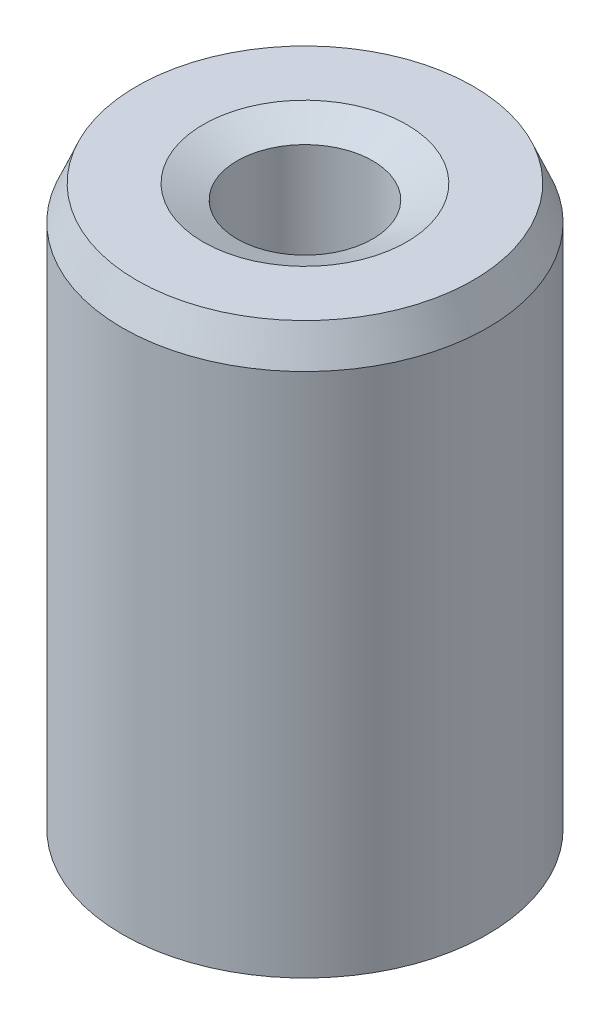
ISO-10303-21;
HEADER;
FILE_DESCRIPTION(('STEP AP214'),'2;1');
FILE_NAME('part.step','',(''),(''),'','','');
FILE_SCHEMA(('AUTOMOTIVE_DESIGN { 1 0 10303 214 1 1 1 1 }'));
ENDSEC;
DATA;
#1=APPLICATION_CONTEXT('core data for automotive mechanical design processes');
#2=APPLICATION_PROTOCOL_DEFINITION('international standard','automotive_design',2000,#1);
#3=PRODUCT_CONTEXT('',#1,'mechanical');
#4=PRODUCT('Part','Part','',(#3));
#5=PRODUCT_RELATED_PRODUCT_CATEGORY('part','',(#4));
#6=PRODUCT_DEFINITION_FORMATION('','',#4);
#7=PRODUCT_DEFINITION_CONTEXT('part definition',#1,'design');
#8=PRODUCT_DEFINITION('design','',#6,#7);
#9=PRODUCT_DEFINITION_SHAPE('','',#8);
#10=(LENGTH_UNIT() NAMED_UNIT(*) SI_UNIT(.MILLI.,.METRE.));
#11=(NAMED_UNIT(*) PLANE_ANGLE_UNIT() SI_UNIT($,.RADIAN.));
#12=(NAMED_UNIT(*) SI_UNIT($,.STERADIAN.) SOLID_ANGLE_UNIT());
#13=UNCERTAINTY_MEASURE_WITH_UNIT(LENGTH_MEASURE(1.E-05),#10,'distance_accuracy_value','');
#14=(GEOMETRIC_REPRESENTATION_CONTEXT(3) GLOBAL_UNCERTAINTY_ASSIGNED_CONTEXT((#13)) GLOBAL_UNIT_ASSIGNED_CONTEXT((#10,
#11,#12)) REPRESENTATION_CONTEXT('',''));
#15=CARTESIAN_POINT('',(0.,0.,0.));
#16=DIRECTION('',(0.,0.,1.));
#17=DIRECTION('',(1.,0.,0.));
#18=AXIS2_PLACEMENT_3D('',#15,#16,#17);
#19=CARTESIAN_POINT('',(0.,15.7118291674004,0.));
#20=DIRECTION('',(0.,-1.,0.));
#21=DIRECTION('',(0.,0.,-1.));
#22=AXIS2_PLACEMENT_3D('',#19,#20,#21);
#23=CYLINDRICAL_SURFACE('',#22,5.);
#24=CARTESIAN_POINT('',(0.,0.394113274534124,0.));
#25=DIRECTION('',(0.,1.,0.));
#26=DIRECTION('',(0.,0.,1.));
#27=AXIS2_PLACEMENT_3D('',#24,#25,#26);
#28=CIRCLE('',#27,5.);
#29=CARTESIAN_POINT('',(0.,0.394113274534124,5.));
#30=VERTEX_POINT('',#29);
#31=EDGE_CURVE('E10',#30,#30,#28,.T.);
#32=ORIENTED_EDGE('',*,*,#31,.T.);
#33=EDGE_LOOP('',(#32));
#34=FACE_BOUND('',#33,.T.);
#35=CARTESIAN_POINT('',(0.,14.780623430353,0.));
#36=DIRECTION('',(0.,1.,0.));
#37=DIRECTION('',(0.,0.,1.));
#38=AXIS2_PLACEMENT_3D('',#35,#36,#37);
#39=CIRCLE('',#38,5.);
#40=CARTESIAN_POINT('',(0.,14.780623430353,5.));
#41=VERTEX_POINT('',#40);
#42=EDGE_CURVE('E50',#41,#41,#39,.F.);
#43=ORIENTED_EDGE('',*,*,#42,.T.);
#44=EDGE_LOOP('',(#43));
#45=FACE_BOUND('',#44,.T.);
#46=ADVANCED_FACE('F39',(#34,#45),#23,.T.);
#47=CARTESIAN_POINT('',(0.,15.7118291674004,0.));
#48=DIRECTION('',(0.,1.,0.));
#49=DIRECTION('',(0.,0.,1.));
#50=AXIS2_PLACEMENT_3D('',#47,#48,#49);
#51=PLANE('',#50);
#52=CARTESIAN_POINT('',(0.,15.7118291674004,0.));
#53=DIRECTION('',(0.,1.,0.));
#54=DIRECTION('',(0.,0.,1.));
#55=AXIS2_PLACEMENT_3D('',#52,#53,#54);
#56=CIRCLE('',#55,2.78754845015359);
#57=CARTESIAN_POINT('',(0.,15.7118291674004,2.78754845015359));
#58=VERTEX_POINT('',#57);
#59=EDGE_CURVE('E58',#58,#58,#56,.F.);
#60=ORIENTED_EDGE('',*,*,#59,.T.);
#61=EDGE_LOOP('',(#60));
#62=FACE_BOUND('',#61,.T.);
#63=CARTESIAN_POINT('',(0.,15.7118291674004,0.));
#64=DIRECTION('',(0.,1.,0.));
#65=DIRECTION('',(0.,0.,1.));
#66=AXIS2_PLACEMENT_3D('',#63,#64,#65);
#67=CIRCLE('',#66,4.60588672546588);
#68=CARTESIAN_POINT('',(0.,15.7118291674004,4.60588672546588));
#69=VERTEX_POINT('',#68);
#70=EDGE_CURVE('E61',#69,#69,#67,.T.);
#71=ORIENTED_EDGE('',*,*,#70,.T.);
#72=EDGE_LOOP('',(#71));
#73=FACE_BOUND('',#72,.T.);
#74=ADVANCED_FACE('F88',(#62,#73),#51,.T.);
#75=CARTESIAN_POINT('',(0.,0.,0.));
#76=DIRECTION('',(0.,1.,0.));
#77=DIRECTION('',(0.,0.,1.));
#78=AXIS2_PLACEMENT_3D('',#75,#76,#77);
#79=PLANE('',#78);
#80=CARTESIAN_POINT('',(0.,0.,0.));
#81=DIRECTION('',(0.,1.,0.));
#82=DIRECTION('',(0.,0.,1.));
#83=AXIS2_PLACEMENT_3D('',#80,#81,#82);
#84=CIRCLE('',#83,2.25045598764031);
#85=CARTESIAN_POINT('',(0.,0.,2.25045598764031));
#86=VERTEX_POINT('',#85);
#87=EDGE_CURVE('E51',#86,#86,#84,.T.);
#88=ORIENTED_EDGE('',*,*,#87,.T.);
#89=EDGE_LOOP('',(#88));
#90=FACE_BOUND('',#89,.T.);
#91=CARTESIAN_POINT('',(0.,0.,0.));
#92=DIRECTION('',(0.,1.,0.));
#93=DIRECTION('',(0.,0.,1.));
#94=AXIS2_PLACEMENT_3D('',#91,#92,#93);
#95=CIRCLE('',#94,4.0687942629526);
#96=CARTESIAN_POINT('',(0.,0.,4.0687942629526));
#97=VERTEX_POINT('',#96);
#98=EDGE_CURVE('E54',#97,#97,#95,.F.);
#99=ORIENTED_EDGE('',*,*,#98,.T.);
#100=EDGE_LOOP('',(#99));
#101=FACE_BOUND('',#100,.T.);
#102=ADVANCED_FACE('F83',(#90,#101),#79,.F.);
#103=CARTESIAN_POINT('',(0.,15.7118291674004,0.));
#104=DIRECTION('',(0.,-1.,0.));
#105=DIRECTION('',(0.,0.,-1.));
#106=AXIS2_PLACEMENT_3D('',#103,#104,#105);
#107=CYLINDRICAL_SURFACE('',#106,1.85634271310619);
#108=CARTESIAN_POINT('',(0.,15.3177158928663,0.));
#109=DIRECTION('',(0.,1.,0.));
#110=DIRECTION('',(0.,0.,1.));
#111=AXIS2_PLACEMENT_3D('',#108,#109,#110);
#112=CIRCLE('',#111,1.85634271310619);
#113=CARTESIAN_POINT('',(0.,15.3177158928663,1.85634271310619));
#114=VERTEX_POINT('',#113);
#115=EDGE_CURVE('E67',#114,#114,#112,.T.);
#116=ORIENTED_EDGE('',*,*,#115,.T.);
#117=EDGE_LOOP('',(#116));
#118=FACE_BOUND('',#117,.T.);
#119=CARTESIAN_POINT('',(0.,0.931205737047405,0.));
#120=DIRECTION('',(0.,1.,0.));
#121=DIRECTION('',(0.,0.,1.));
#122=AXIS2_PLACEMENT_3D('',#119,#120,#121);
#123=CIRCLE('',#122,1.85634271310619);
#124=CARTESIAN_POINT('',(0.,0.931205737047405,1.85634271310619));
#125=VERTEX_POINT('',#124);
#126=EDGE_CURVE('E69',#125,#125,#123,.F.);
#127=ORIENTED_EDGE('',*,*,#126,.T.);
#128=EDGE_LOOP('',(#127));
#129=FACE_BOUND('',#128,.T.);
#130=ADVANCED_FACE('F71',(#118,#129),#107,.F.);
#131=CARTESIAN_POINT('',(0.,15.3177158928663,0.));
#132=DIRECTION('',(0.,1.,0.));
#133=DIRECTION('',(0.,0.,1.));
#134=AXIS2_PLACEMENT_3D('',#131,#132,#133);
#135=CONICAL_SURFACE('',#134,1.85634271310619,1.17042668659071);
#136=ORIENTED_EDGE('',*,*,#59,.F.);
#137=EDGE_LOOP('',(#136));
#138=FACE_BOUND('',#137,.T.);
#139=ORIENTED_EDGE('',*,*,#115,.F.);
#140=EDGE_LOOP('',(#139));
#141=FACE_BOUND('',#140,.T.);
#142=ADVANCED_FACE('F77',(#138,#141),#135,.F.);
#143=CARTESIAN_POINT('',(0.,0.,0.));
#144=DIRECTION('',(0.,-1.,0.));
#145=DIRECTION('',(0.,0.,-1.));
#146=AXIS2_PLACEMENT_3D('',#143,#144,#145);
#147=CONICAL_SURFACE('',#146,2.25045598764031,0.400369640204184);
#148=ORIENTED_EDGE('',*,*,#126,.F.);
#149=EDGE_LOOP('',(#148));
#150=FACE_BOUND('',#149,.T.);
#151=ORIENTED_EDGE('',*,*,#87,.F.);
#152=EDGE_LOOP('',(#151));
#153=FACE_BOUND('',#152,.T.);
#154=ADVANCED_FACE('F73',(#150,#153),#147,.F.);
#155=CARTESIAN_POINT('',(0.,0.394113274534124,0.));
#156=DIRECTION('',(0.,1.,0.));
#157=DIRECTION('',(0.,0.,1.));
#158=AXIS2_PLACEMENT_3D('',#155,#156,#157);
#159=CONICAL_SURFACE('',#158,5.,1.17042668659071);
#160=CARTESIAN_POINT('',(0.,0.,4.0687942629526));
#161=CARTESIAN_POINT('',(0.,0.00410534660973057,4.07849432271351));
#162=CARTESIAN_POINT('',(0.,0.00821069321946098,4.08819438247442));
#163=CARTESIAN_POINT('',(0.,0.0164213864389218,4.10759450199624));
#164=CARTESIAN_POINT('',(0.,0.0205267330486522,4.11729456175715));
#165=CARTESIAN_POINT('',(0.,0.0287374262681131,4.13669468127897));
#166=CARTESIAN_POINT('',(0.,0.0328427728778437,4.14639474103988));
#167=CARTESIAN_POINT('',(0.,0.0410534660973046,4.1657948605617));
#168=CARTESIAN_POINT('',(0.,0.045158812707035,4.17549492032261));
#169=CARTESIAN_POINT('',(0.,0.0533695059264959,4.19489503984444));
#170=CARTESIAN_POINT('',(0.,0.0574748525362264,4.20459509960534));
#171=CARTESIAN_POINT('',(0.,0.0656855457556874,4.22399521912717));
#172=CARTESIAN_POINT('',(0.,0.0697908923654178,4.23369527888808));
#173=CARTESIAN_POINT('',(0.,0.0780015855848787,4.2530953984099));
#174=CARTESIAN_POINT('',(0.,0.0821069321946092,4.26279545817081));
#175=CARTESIAN_POINT('',(0.,0.0903176254140701,4.28219557769263));
#176=CARTESIAN_POINT('',(0.,0.0944229720238006,4.29189563745354));
#177=CARTESIAN_POINT('',(0.,0.102633665243262,4.31129575697536));
#178=CARTESIAN_POINT('',(0.,0.106739011852992,4.32099581673627));
#179=CARTESIAN_POINT('',(0.,0.114949705072453,4.34039593625809));
#180=CARTESIAN_POINT('',(0.,0.119055051682183,4.350095996019));
#181=CARTESIAN_POINT('',(0.,0.127265744901644,4.36949611554082));
#182=CARTESIAN_POINT('',(0.,0.131371091511375,4.37919617530173));
#183=CARTESIAN_POINT('',(0.,0.139581784730836,4.39859629482355));
#184=CARTESIAN_POINT('',(0.,0.143687131340566,4.40829635458446));
#185=CARTESIAN_POINT('',(0.,0.151897824560027,4.42769647410628));
#186=CARTESIAN_POINT('',(0.,0.156003171169757,4.4373965338672));
#187=CARTESIAN_POINT('',(0.,0.164213864389218,4.45679665338902));
#188=CARTESIAN_POINT('',(0.,0.168319210998949,4.46649671314993));
#189=CARTESIAN_POINT('',(0.,0.17652990421841,4.48589683267175));
#190=CARTESIAN_POINT('',(0.,0.18063525082814,4.49559689243266));
#191=CARTESIAN_POINT('',(0.,0.188845944047601,4.51499701195448));
#192=CARTESIAN_POINT('',(0.,0.192951290657332,4.52469707171539));
#193=CARTESIAN_POINT('',(0.,0.201161983876793,4.54409719123721));
#194=CARTESIAN_POINT('',(0.,0.205267330486523,4.55379725099812));
#195=CARTESIAN_POINT('',(0.,0.213478023705984,4.57319737051994));
#196=CARTESIAN_POINT('',(0.,0.217583370315715,4.58289743028085));
#197=CARTESIAN_POINT('',(0.,0.225794063535175,4.60229754980267));
#198=CARTESIAN_POINT('',(0.,0.229899410144906,4.61199760956358));
#199=CARTESIAN_POINT('',(0.,0.238110103364367,4.6313977290854));
#200=CARTESIAN_POINT('',(0.,0.242215449974097,4.64109778884631));
#201=CARTESIAN_POINT('',(0.,0.250426143193558,4.66049790836813));
#202=CARTESIAN_POINT('',(0.,0.254531489803289,4.67019796812905));
#203=CARTESIAN_POINT('',(0.,0.262742183022749,4.68959808765087));
#204=CARTESIAN_POINT('',(0.,0.26684752963248,4.69929814741178));
#205=CARTESIAN_POINT('',(0.,0.275058222851941,4.7186982669336));
#206=CARTESIAN_POINT('',(0.,0.279163569461671,4.72839832669451));
#207=CARTESIAN_POINT('',(0.,0.287374262681132,4.74779844621633));
#208=CARTESIAN_POINT('',(0.,0.291479609290863,4.75749850597724));
#209=CARTESIAN_POINT('',(0.,0.299690302510324,4.77689862549906));
#210=CARTESIAN_POINT('',(0.,0.303795649120054,4.78659868525997));
#211=CARTESIAN_POINT('',(0.,0.312006342339515,4.80599880478179));
#212=CARTESIAN_POINT('',(0.,0.316111688949246,4.8156988645427));
#213=CARTESIAN_POINT('',(0.,0.324322382168706,4.83509898406452));
#214=CARTESIAN_POINT('',(0.,0.328427728778437,4.84479904382543));
#215=CARTESIAN_POINT('',(0.,0.336638421997898,4.86419916334725));
#216=CARTESIAN_POINT('',(0.,0.340743768607628,4.87389922310816));
#217=CARTESIAN_POINT('',(0.,0.348954461827089,4.89329934262999));
#218=CARTESIAN_POINT('',(0.,0.35305980843682,4.9029994023909));
#219=CARTESIAN_POINT('',(0.,0.361270501656281,4.92239952191272));
#220=CARTESIAN_POINT('',(0.,0.365375848266011,4.93209958167363));
#221=CARTESIAN_POINT('',(0.,0.373586541485472,4.95149970119545));
#222=CARTESIAN_POINT('',(0.,0.377691888095202,4.96119976095636));
#223=CARTESIAN_POINT('',(0.,0.385902581314664,4.98059988047818));
#224=CARTESIAN_POINT('',(0.,0.390007927924394,4.99029994023909));
#225=CARTESIAN_POINT('',(0.,0.394113274534124,5.));
#226=B_SPLINE_CURVE_WITH_KNOTS('',3,(#160,#161,#162,#163,#164,#165,#166,#167,#168,#169,#170,
#171,#172,#173,#174,#175,#176,#177,#178,#179,#180,#181,#182,#183,#184,#185,#186,#187,#188,#189,
#190,#191,#192,#193,#194,#195,#196,#197,#198,#199,#200,#201,#202,#203,#204,#205,#206,#207,#208,
#209,#210,#211,#212,#213,#214,#215,#216,#217,#218,#219,#220,#221,#222,#223,#224,#225),
.UNSPECIFIED.,.F.,.F.,(4,2,2,2,2,2,2,2,2,2,2,2,2,2,2,2,2,2,2,2,2,2,2,2,2,2,2,2,2,2,2,2,4),(0.,
0.0315991340286614,0.0631982680573235,0.0947974020859848,0.126396536114647,0.157995670143308,
0.18959480417197,0.221193938200633,0.252793072229294,0.284392206257956,0.315991340286618,
0.34759047431528,0.379189608343941,0.410788742372603,0.442387876401265,0.473987010429927,
0.505586144458588,0.53718527848725,0.568784412515911,0.600383546544574,0.631982680573235,
0.663581814601897,0.695180948630559,0.726780082659221,0.758379216687883,0.789978350716544,
0.821577484745206,0.853176618773868,0.88477575280253,0.916374886831191,0.947974020859853,
0.979573154888515,1.01117228891718),.UNSPECIFIED.);
#227=EDGE_CURVE('BSEAM76',#97,#30,#226,.T.);
#228=ORIENTED_EDGE('',*,*,#98,.F.);
#229=ORIENTED_EDGE('',*,*,#31,.F.);
#230=ORIENTED_EDGE('',*,*,#227,.T.);
#231=ORIENTED_EDGE('',*,*,#227,.F.);
#232=EDGE_LOOP('',(#228,#230,#229,#231));
#233=FACE_BOUND('',#232,.T.);
#234=ADVANCED_FACE('F76',(#233),#159,.T.);
#235=CARTESIAN_POINT('',(0.,15.7118291674004,0.));
#236=DIRECTION('',(0.,-1.,0.));
#237=DIRECTION('',(0.,0.,-1.));
#238=AXIS2_PLACEMENT_3D('',#235,#236,#237);
#239=CONICAL_SURFACE('',#238,4.60588672546588,0.400369640204184);
#240=ORIENTED_EDGE('',*,*,#42,.F.);
#241=EDGE_LOOP('',(#240));
#242=FACE_BOUND('',#241,.T.);
#243=ORIENTED_EDGE('',*,*,#70,.F.);
#244=EDGE_LOOP('',(#243));
#245=FACE_BOUND('',#244,.T.);
#246=ADVANCED_FACE('F45',(#242,#245),#239,.T.);
#247=CLOSED_SHELL('',(#46,#74,#102,#130,#142,#154,#234,#246));
#248=MANIFOLD_SOLID_BREP('B2',#247);
#249=ADVANCED_BREP_SHAPE_REPRESENTATION('',(#18,#248),#14);
#250=SHAPE_DEFINITION_REPRESENTATION(#9,#249);
ENDSEC;
END-ISO-10303-21;
